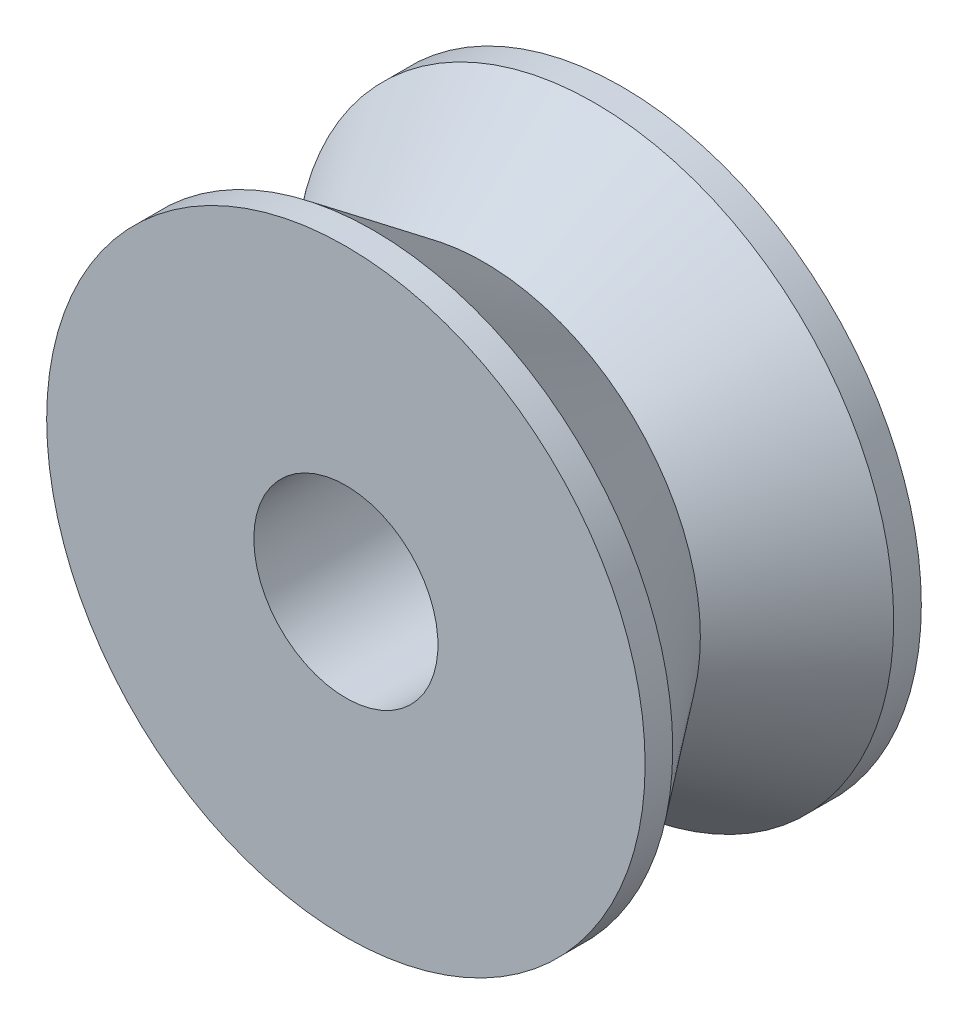
ISO-10303-21;
HEADER;
FILE_DESCRIPTION(('STEP AP214'),'2;1');
FILE_NAME('part.step','',(''),(''),'','','');
FILE_SCHEMA(('AUTOMOTIVE_DESIGN { 1 0 10303 214 1 1 1 1 }'));
ENDSEC;
DATA;
#1=APPLICATION_CONTEXT('core data for automotive mechanical design processes');
#2=APPLICATION_PROTOCOL_DEFINITION('international standard','automotive_design',2000,#1);
#3=PRODUCT_CONTEXT('',#1,'mechanical');
#4=PRODUCT('Part','Part','',(#3));
#5=PRODUCT_RELATED_PRODUCT_CATEGORY('part','',(#4));
#6=PRODUCT_DEFINITION_FORMATION('','',#4);
#7=PRODUCT_DEFINITION_CONTEXT('part definition',#1,'design');
#8=PRODUCT_DEFINITION('design','',#6,#7);
#9=PRODUCT_DEFINITION_SHAPE('','',#8);
#10=(LENGTH_UNIT() NAMED_UNIT(*) SI_UNIT(.MILLI.,.METRE.));
#11=(NAMED_UNIT(*) PLANE_ANGLE_UNIT() SI_UNIT($,.RADIAN.));
#12=(NAMED_UNIT(*) SI_UNIT($,.STERADIAN.) SOLID_ANGLE_UNIT());
#13=UNCERTAINTY_MEASURE_WITH_UNIT(LENGTH_MEASURE(1.E-05),#10,'distance_accuracy_value','');
#14=(GEOMETRIC_REPRESENTATION_CONTEXT(3) GLOBAL_UNCERTAINTY_ASSIGNED_CONTEXT((#13)) GLOBAL_UNIT_ASSIGNED_CONTEXT((#10,
#11,#12)) REPRESENTATION_CONTEXT('',''));
#15=CARTESIAN_POINT('',(0.,0.,0.));
#16=DIRECTION('',(0.,0.,1.));
#17=DIRECTION('',(1.,0.,0.));
#18=AXIS2_PLACEMENT_3D('',#15,#16,#17);
#19=CARTESIAN_POINT('',(0.,2.,-3.));
#20=DIRECTION('',(0.,0.,-1.));
#21=DIRECTION('',(-1.,0.,0.));
#22=AXIS2_PLACEMENT_3D('',#19,#20,#21);
#23=PLANE('',#22);
#24=CARTESIAN_POINT('',(0.,0.,-3.));
#25=DIRECTION('',(0.,0.,-1.));
#26=DIRECTION('',(-1.,0.,0.));
#27=AXIS2_PLACEMENT_3D('',#24,#25,#26);
#28=CIRCLE('',#27,6.5);
#29=CARTESIAN_POINT('',(-6.5,0.,-3.));
#30=VERTEX_POINT('',#29);
#31=EDGE_CURVE('E10',#30,#30,#28,.T.);
#32=ORIENTED_EDGE('',*,*,#31,.T.);
#33=EDGE_LOOP('',(#32));
#34=FACE_BOUND('',#33,.T.);
#35=CARTESIAN_POINT('',(0.,0.,-3.));
#36=DIRECTION('',(0.,0.,-1.));
#37=DIRECTION('',(-1.,0.,0.));
#38=AXIS2_PLACEMENT_3D('',#35,#36,#37);
#39=CIRCLE('',#38,2.);
#40=CARTESIAN_POINT('',(-2.,0.,-3.));
#41=VERTEX_POINT('',#40);
#42=EDGE_CURVE('E57',#41,#41,#39,.T.);
#43=ORIENTED_EDGE('',*,*,#42,.F.);
#44=EDGE_LOOP('',(#43));
#45=FACE_BOUND('',#44,.T.);
#46=ADVANCED_FACE('F32',(#34,#45),#23,.T.);
#47=CARTESIAN_POINT('',(0.,0.,0.));
#48=DIRECTION('',(0.,0.,-1.));
#49=DIRECTION('',(-1.,0.,0.));
#50=AXIS2_PLACEMENT_3D('',#47,#48,#49);
#51=CYLINDRICAL_SURFACE('',#50,6.5);
#52=CARTESIAN_POINT('',(0.,0.,-2.4));
#53=DIRECTION('',(0.,0.,-1.));
#54=DIRECTION('',(-1.,0.,0.));
#55=AXIS2_PLACEMENT_3D('',#52,#53,#54);
#56=CIRCLE('',#55,6.5);
#57=CARTESIAN_POINT('',(-6.5,0.,-2.4));
#58=VERTEX_POINT('',#57);
#59=EDGE_CURVE('E38',#58,#58,#56,.T.);
#60=ORIENTED_EDGE('',*,*,#59,.T.);
#61=EDGE_LOOP('',(#60));
#62=FACE_BOUND('',#61,.T.);
#63=ORIENTED_EDGE('',*,*,#31,.F.);
#64=EDGE_LOOP('',(#63));
#65=FACE_BOUND('',#64,.T.);
#66=ADVANCED_FACE('F65',(#62,#65),#51,.T.);
#67=CARTESIAN_POINT('',(0.,0.,-2.4));
#68=DIRECTION('',(0.,0.,-1.));
#69=DIRECTION('',(-1.,0.,0.));
#70=AXIS2_PLACEMENT_3D('',#67,#68,#69);
#71=CONICAL_SURFACE('',#70,6.5,0.643501108793284);
#72=CARTESIAN_POINT('',(0.,0.,0.));
#73=DIRECTION('',(0.,0.,-1.));
#74=DIRECTION('',(-1.,0.,0.));
#75=AXIS2_PLACEMENT_3D('',#72,#73,#74);
#76=CIRCLE('',#75,4.7);
#77=CARTESIAN_POINT('',(-4.7,0.,0.));
#78=VERTEX_POINT('',#77);
#79=EDGE_CURVE('E42',#78,#78,#76,.T.);
#80=ORIENTED_EDGE('',*,*,#79,.T.);
#81=EDGE_LOOP('',(#80));
#82=FACE_BOUND('',#81,.T.);
#83=ORIENTED_EDGE('',*,*,#59,.F.);
#84=EDGE_LOOP('',(#83));
#85=FACE_BOUND('',#84,.T.);
#86=ADVANCED_FACE('F69',(#82,#85),#71,.T.);
#87=CARTESIAN_POINT('',(0.,0.,0.));
#88=DIRECTION('',(0.,0.,1.));
#89=DIRECTION('',(1.,0.,0.));
#90=AXIS2_PLACEMENT_3D('',#87,#88,#89);
#91=CONICAL_SURFACE('',#90,4.7,0.643501108793284);
#92=CARTESIAN_POINT('',(0.,0.,2.4));
#93=DIRECTION('',(0.,0.,-1.));
#94=DIRECTION('',(-1.,0.,0.));
#95=AXIS2_PLACEMENT_3D('',#92,#93,#94);
#96=CIRCLE('',#95,6.5);
#97=CARTESIAN_POINT('',(-6.5,0.,2.4));
#98=VERTEX_POINT('',#97);
#99=EDGE_CURVE('E46',#98,#98,#96,.T.);
#100=ORIENTED_EDGE('',*,*,#99,.T.);
#101=EDGE_LOOP('',(#100));
#102=FACE_BOUND('',#101,.T.);
#103=ORIENTED_EDGE('',*,*,#79,.F.);
#104=EDGE_LOOP('',(#103));
#105=FACE_BOUND('',#104,.T.);
#106=ADVANCED_FACE('F73',(#102,#105),#91,.T.);
#107=CARTESIAN_POINT('',(0.,0.,0.));
#108=DIRECTION('',(0.,0.,-1.));
#109=DIRECTION('',(-1.,0.,0.));
#110=AXIS2_PLACEMENT_3D('',#107,#108,#109);
#111=CYLINDRICAL_SURFACE('',#110,6.5);
#112=CARTESIAN_POINT('',(0.,0.,3.));
#113=DIRECTION('',(0.,0.,-1.));
#114=DIRECTION('',(-1.,0.,0.));
#115=AXIS2_PLACEMENT_3D('',#112,#113,#114);
#116=CIRCLE('',#115,6.5);
#117=CARTESIAN_POINT('',(-6.5,0.,3.));
#118=VERTEX_POINT('',#117);
#119=EDGE_CURVE('E51',#118,#118,#116,.T.);
#120=ORIENTED_EDGE('',*,*,#119,.T.);
#121=EDGE_LOOP('',(#120));
#122=FACE_BOUND('',#121,.T.);
#123=ORIENTED_EDGE('',*,*,#99,.F.);
#124=EDGE_LOOP('',(#123));
#125=FACE_BOUND('',#124,.T.);
#126=ADVANCED_FACE('F80',(#122,#125),#111,.T.);
#127=CARTESIAN_POINT('',(0.,2.,3.));
#128=DIRECTION('',(0.,0.,1.));
#129=DIRECTION('',(1.,0.,0.));
#130=AXIS2_PLACEMENT_3D('',#127,#128,#129);
#131=PLANE('',#130);
#132=CARTESIAN_POINT('',(0.,0.,3.));
#133=DIRECTION('',(0.,0.,-1.));
#134=DIRECTION('',(-1.,0.,0.));
#135=AXIS2_PLACEMENT_3D('',#132,#133,#134);
#136=CIRCLE('',#135,2.);
#137=CARTESIAN_POINT('',(-2.,0.,3.));
#138=VERTEX_POINT('',#137);
#139=EDGE_CURVE('E54',#138,#138,#136,.T.);
#140=ORIENTED_EDGE('',*,*,#139,.T.);
#141=EDGE_LOOP('',(#140));
#142=FACE_BOUND('',#141,.T.);
#143=ORIENTED_EDGE('',*,*,#119,.F.);
#144=EDGE_LOOP('',(#143));
#145=FACE_BOUND('',#144,.T.);
#146=ADVANCED_FACE('F84',(#142,#145),#131,.T.);
#147=CARTESIAN_POINT('',(0.,0.,0.));
#148=DIRECTION('',(0.,0.,-1.));
#149=DIRECTION('',(-1.,0.,0.));
#150=AXIS2_PLACEMENT_3D('',#147,#148,#149);
#151=CYLINDRICAL_SURFACE('',#150,2.);
#152=ORIENTED_EDGE('',*,*,#42,.T.);
#153=EDGE_LOOP('',(#152));
#154=FACE_BOUND('',#153,.T.);
#155=ORIENTED_EDGE('',*,*,#139,.F.);
#156=EDGE_LOOP('',(#155));
#157=FACE_BOUND('',#156,.T.);
#158=ADVANCED_FACE('F61',(#154,#157),#151,.F.);
#159=CLOSED_SHELL('',(#46,#66,#86,#106,#126,#146,#158));
#160=MANIFOLD_SOLID_BREP('B2',#159);
#161=ADVANCED_BREP_SHAPE_REPRESENTATION('',(#18,#160),#14);
#162=SHAPE_DEFINITION_REPRESENTATION(#9,#161);
ENDSEC;
END-ISO-10303-21;
